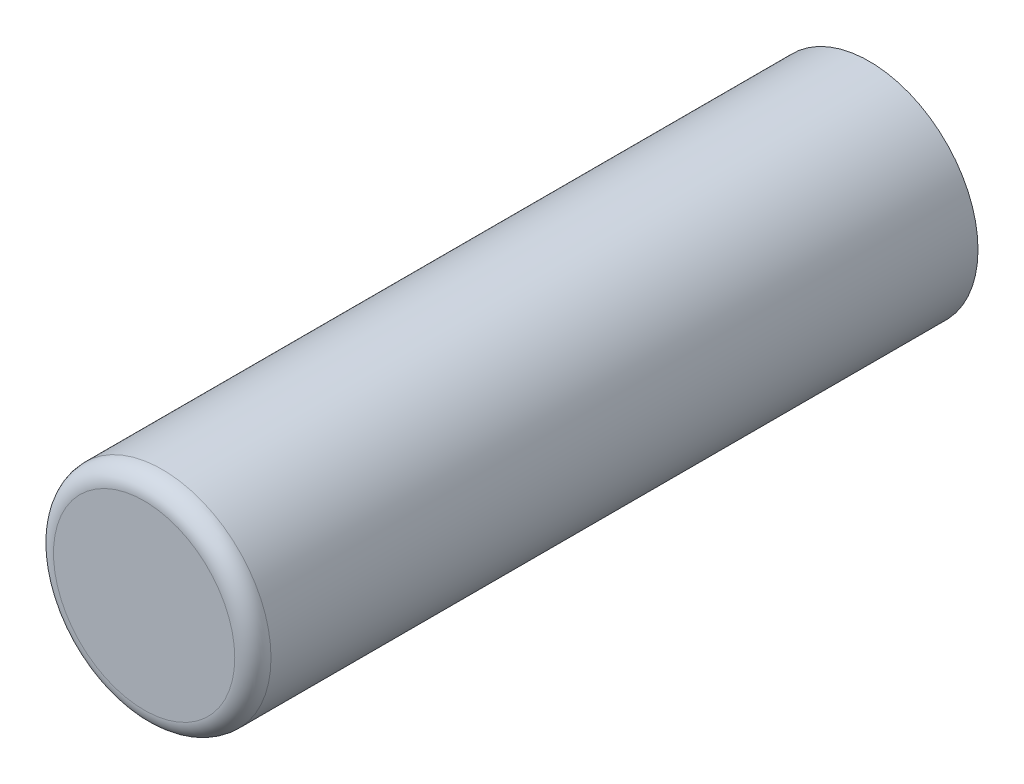
ISO-10303-21;
HEADER;
FILE_DESCRIPTION(('STEP AP214'),'2;1');
FILE_NAME('part.step','',(''),(''),'','','');
FILE_SCHEMA(('AUTOMOTIVE_DESIGN { 1 0 10303 214 1 1 1 1 }'));
ENDSEC;
DATA;
#1=APPLICATION_CONTEXT('core data for automotive mechanical design processes');
#2=APPLICATION_PROTOCOL_DEFINITION('international standard','automotive_design',2000,#1);
#3=PRODUCT_CONTEXT('',#1,'mechanical');
#4=PRODUCT('Part','Part','',(#3));
#5=PRODUCT_RELATED_PRODUCT_CATEGORY('part','',(#4));
#6=PRODUCT_DEFINITION_FORMATION('','',#4);
#7=PRODUCT_DEFINITION_CONTEXT('part definition',#1,'design');
#8=PRODUCT_DEFINITION('design','',#6,#7);
#9=PRODUCT_DEFINITION_SHAPE('','',#8);
#10=(LENGTH_UNIT() NAMED_UNIT(*) SI_UNIT(.MILLI.,.METRE.));
#11=(NAMED_UNIT(*) PLANE_ANGLE_UNIT() SI_UNIT($,.RADIAN.));
#12=(NAMED_UNIT(*) SI_UNIT($,.STERADIAN.) SOLID_ANGLE_UNIT());
#13=UNCERTAINTY_MEASURE_WITH_UNIT(LENGTH_MEASURE(1.E-05),#10,'distance_accuracy_value','');
#14=(GEOMETRIC_REPRESENTATION_CONTEXT(3) GLOBAL_UNCERTAINTY_ASSIGNED_CONTEXT((#13)) GLOBAL_UNIT_ASSIGNED_CONTEXT((#10,
#11,#12)) REPRESENTATION_CONTEXT('',''));
#15=CARTESIAN_POINT('',(0.,0.,0.));
#16=DIRECTION('',(0.,0.,1.));
#17=DIRECTION('',(1.,0.,0.));
#18=AXIS2_PLACEMENT_3D('',#15,#16,#17);
#19=CARTESIAN_POINT('',(0.,0.,16.));
#20=DIRECTION('',(0.,0.,-1.));
#21=DIRECTION('',(-1.,0.,0.));
#22=AXIS2_PLACEMENT_3D('',#19,#20,#21);
#23=CYLINDRICAL_SURFACE('',#22,4.8);
#24=CARTESIAN_POINT('',(0.,0.,15.2));
#25=DIRECTION('',(0.,0.,1.));
#26=DIRECTION('',(1.,0.,0.));
#27=AXIS2_PLACEMENT_3D('',#24,#25,#26);
#28=CIRCLE('',#27,4.8);
#29=CARTESIAN_POINT('',(4.8,0.,15.2));
#30=VERTEX_POINT('',#29);
#31=EDGE_CURVE('E10',#30,#30,#28,.F.);
#32=ORIENTED_EDGE('',*,*,#31,.T.);
#33=EDGE_LOOP('',(#32));
#34=FACE_BOUND('',#33,.T.);
#35=CARTESIAN_POINT('',(0.,0.,-16.));
#36=DIRECTION('',(0.,0.,1.));
#37=DIRECTION('',(1.,0.,0.));
#38=AXIS2_PLACEMENT_3D('',#35,#36,#37);
#39=CIRCLE('',#38,4.8);
#40=CARTESIAN_POINT('',(4.8,0.,-16.));
#41=VERTEX_POINT('',#40);
#42=EDGE_CURVE('E45',#41,#41,#39,.T.);
#43=ORIENTED_EDGE('',*,*,#42,.T.);
#44=EDGE_LOOP('',(#43));
#45=FACE_BOUND('',#44,.T.);
#46=ADVANCED_FACE('F34',(#34,#45),#23,.T.);
#47=CARTESIAN_POINT('',(0.,0.,16.));
#48=DIRECTION('',(0.,0.,1.));
#49=DIRECTION('',(1.,0.,0.));
#50=AXIS2_PLACEMENT_3D('',#47,#48,#49);
#51=PLANE('',#50);
#52=CARTESIAN_POINT('',(0.,0.,16.));
#53=DIRECTION('',(0.,0.,1.));
#54=DIRECTION('',(1.,0.,0.));
#55=AXIS2_PLACEMENT_3D('',#52,#53,#54);
#56=CIRCLE('',#55,4.);
#57=CARTESIAN_POINT('',(4.,0.,16.));
#58=VERTEX_POINT('',#57);
#59=EDGE_CURVE('E41',#58,#58,#56,.T.);
#60=ORIENTED_EDGE('',*,*,#59,.T.);
#61=EDGE_LOOP('',(#60));
#62=FACE_BOUND('',#61,.T.);
#63=ADVANCED_FACE('F55',(#62),#51,.T.);
#64=CARTESIAN_POINT('',(0.,0.,-16.));
#65=DIRECTION('',(0.,0.,1.));
#66=DIRECTION('',(1.,0.,0.));
#67=AXIS2_PLACEMENT_3D('',#64,#65,#66);
#68=PLANE('',#67);
#69=ORIENTED_EDGE('',*,*,#42,.F.);
#70=EDGE_LOOP('',(#69));
#71=FACE_BOUND('',#70,.T.);
#72=ADVANCED_FACE('F53',(#71),#68,.F.);
#73=CARTESIAN_POINT('',(0.,0.,15.2));
#74=DIRECTION('',(0.,0.,1.));
#75=DIRECTION('',(1.,0.,0.));
#76=AXIS2_PLACEMENT_3D('',#73,#74,#75);
#77=TOROIDAL_SURFACE('',#76,4.,0.8);
#78=ORIENTED_EDGE('',*,*,#31,.F.);
#79=EDGE_LOOP('',(#78));
#80=FACE_BOUND('',#79,.T.);
#81=ORIENTED_EDGE('',*,*,#59,.F.);
#82=EDGE_LOOP('',(#81));
#83=FACE_BOUND('',#82,.T.);
#84=ADVANCED_FACE('F36',(#80,#83),#77,.T.);
#85=CLOSED_SHELL('',(#46,#63,#72,#84));
#86=MANIFOLD_SOLID_BREP('B2',#85);
#87=ADVANCED_BREP_SHAPE_REPRESENTATION('',(#18,#86),#14);
#88=SHAPE_DEFINITION_REPRESENTATION(#9,#87);
ENDSEC;
END-ISO-10303-21;
